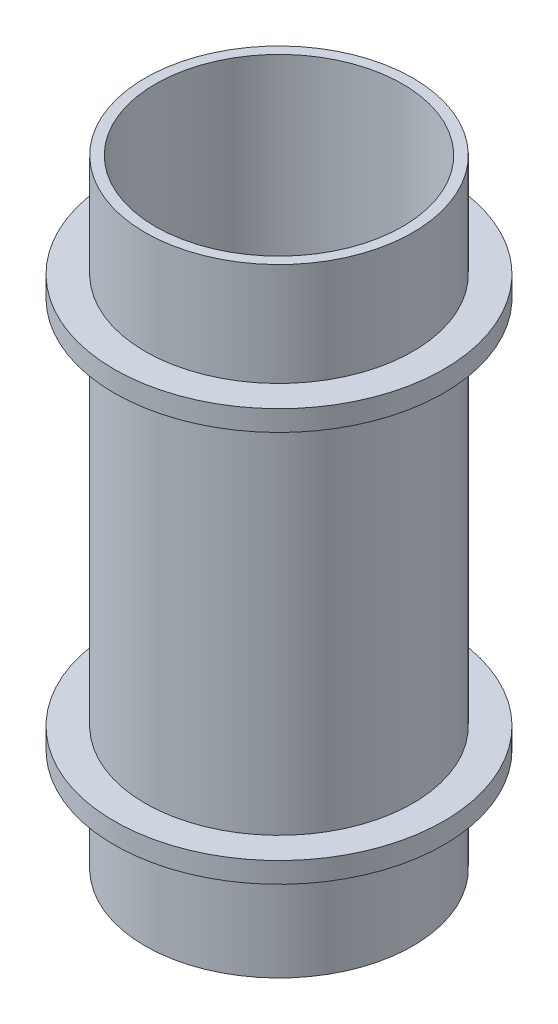
ISO-10303-21;
HEADER;
FILE_DESCRIPTION(('STEP AP214'),'2;1');
FILE_NAME('part.step','',(''),(''),'','','');
FILE_SCHEMA(('AUTOMOTIVE_DESIGN { 1 0 10303 214 1 1 1 1 }'));
ENDSEC;
DATA;
#1=APPLICATION_CONTEXT('core data for automotive mechanical design processes');
#2=APPLICATION_PROTOCOL_DEFINITION('international standard','automotive_design',2000,#1);
#3=PRODUCT_CONTEXT('',#1,'mechanical');
#4=PRODUCT('Part','Part','',(#3));
#5=PRODUCT_RELATED_PRODUCT_CATEGORY('part','',(#4));
#6=PRODUCT_DEFINITION_FORMATION('','',#4);
#7=PRODUCT_DEFINITION_CONTEXT('part definition',#1,'design');
#8=PRODUCT_DEFINITION('design','',#6,#7);
#9=PRODUCT_DEFINITION_SHAPE('','',#8);
#10=(LENGTH_UNIT() NAMED_UNIT(*) SI_UNIT(.MILLI.,.METRE.));
#11=(NAMED_UNIT(*) PLANE_ANGLE_UNIT() SI_UNIT($,.RADIAN.));
#12=(NAMED_UNIT(*) SI_UNIT($,.STERADIAN.) SOLID_ANGLE_UNIT());
#13=UNCERTAINTY_MEASURE_WITH_UNIT(LENGTH_MEASURE(1.E-05),#10,'distance_accuracy_value','');
#14=(GEOMETRIC_REPRESENTATION_CONTEXT(3) GLOBAL_UNCERTAINTY_ASSIGNED_CONTEXT((#13)) GLOBAL_UNIT_ASSIGNED_CONTEXT((#10,
#11,#12)) REPRESENTATION_CONTEXT('',''));
#15=CARTESIAN_POINT('',(0.,0.,0.));
#16=DIRECTION('',(0.,0.,1.));
#17=DIRECTION('',(1.,0.,0.));
#18=AXIS2_PLACEMENT_3D('',#15,#16,#17);
#19=CARTESIAN_POINT('',(0.,60.,0.));
#20=DIRECTION('',(0.,-1.,0.));
#21=DIRECTION('',(0.,0.,-1.));
#22=AXIS2_PLACEMENT_3D('',#19,#20,#21);
#23=CYLINDRICAL_SURFACE('',#22,13.);
#24=CARTESIAN_POINT('',(0.,48.,0.));
#25=DIRECTION('',(0.,1.,0.));
#26=DIRECTION('',(0.,0.,1.));
#27=AXIS2_PLACEMENT_3D('',#24,#25,#26);
#28=CIRCLE('',#27,13.);
#29=CARTESIAN_POINT('',(0.,48.,13.));
#30=VERTEX_POINT('',#29);
#31=EDGE_CURVE('E42',#30,#30,#28,.T.);
#32=ORIENTED_EDGE('',*,*,#31,.F.);
#33=EDGE_LOOP('',(#32));
#34=FACE_BOUND('',#33,.T.);
#35=CARTESIAN_POINT('',(0.,12.,0.));
#36=DIRECTION('',(0.,-1.,0.));
#37=DIRECTION('',(0.,0.,-1.));
#38=AXIS2_PLACEMENT_3D('',#35,#36,#37);
#39=CIRCLE('',#38,13.);
#40=CARTESIAN_POINT('',(0.,12.,-13.));
#41=VERTEX_POINT('',#40);
#42=EDGE_CURVE('E10',#41,#41,#39,.T.);
#43=ORIENTED_EDGE('',*,*,#42,.F.);
#44=EDGE_LOOP('',(#43));
#45=FACE_BOUND('',#44,.T.);
#46=ADVANCED_FACE('F34',(#34,#45),#23,.T.);
#47=CARTESIAN_POINT('',(0.,10.,0.));
#48=DIRECTION('',(0.,-1.,0.));
#49=DIRECTION('',(0.,0.,-1.));
#50=AXIS2_PLACEMENT_3D('',#47,#48,#49);
#51=CIRCLE('',#50,13.);
#52=CARTESIAN_POINT('',(0.,10.,-13.));
#53=VERTEX_POINT('',#52);
#54=EDGE_CURVE('E51',#53,#53,#51,.T.);
#55=ORIENTED_EDGE('',*,*,#54,.T.);
#56=EDGE_LOOP('',(#55));
#57=FACE_BOUND('',#56,.T.);
#58=CARTESIAN_POINT('',(0.,0.,0.));
#59=DIRECTION('',(0.,1.,0.));
#60=DIRECTION('',(0.,0.,1.));
#61=AXIS2_PLACEMENT_3D('',#58,#59,#60);
#62=CIRCLE('',#61,13.);
#63=CARTESIAN_POINT('',(0.,0.,13.));
#64=VERTEX_POINT('',#63);
#65=EDGE_CURVE('E38',#64,#64,#62,.T.);
#66=ORIENTED_EDGE('',*,*,#65,.T.);
#67=EDGE_LOOP('',(#66));
#68=FACE_BOUND('',#67,.T.);
#69=ADVANCED_FACE('F73',(#57,#68),#23,.T.);
#70=CARTESIAN_POINT('',(0.,60.,0.));
#71=DIRECTION('',(0.,1.,0.));
#72=DIRECTION('',(0.,0.,1.));
#73=AXIS2_PLACEMENT_3D('',#70,#71,#72);
#74=PLANE('',#73);
#75=CARTESIAN_POINT('',(0.,60.,0.));
#76=DIRECTION('',(0.,1.,0.));
#77=DIRECTION('',(0.,0.,1.));
#78=AXIS2_PLACEMENT_3D('',#75,#76,#77);
#79=CIRCLE('',#78,13.);
#80=CARTESIAN_POINT('',(0.,60.,13.));
#81=VERTEX_POINT('',#80);
#82=EDGE_CURVE('E47',#81,#81,#79,.T.);
#83=ORIENTED_EDGE('',*,*,#82,.T.);
#84=EDGE_LOOP('',(#83));
#85=FACE_BOUND('',#84,.T.);
#86=CARTESIAN_POINT('',(0.,60.,0.));
#87=DIRECTION('',(0.,1.,0.));
#88=DIRECTION('',(0.,0.,1.));
#89=AXIS2_PLACEMENT_3D('',#86,#87,#88);
#90=CIRCLE('',#89,12.);
#91=CARTESIAN_POINT('',(0.,60.,12.));
#92=VERTEX_POINT('',#91);
#93=EDGE_CURVE('E63',#92,#92,#90,.T.);
#94=ORIENTED_EDGE('',*,*,#93,.F.);
#95=EDGE_LOOP('',(#94));
#96=FACE_BOUND('',#95,.T.);
#97=ADVANCED_FACE('F78',(#85,#96),#74,.T.);
#98=CARTESIAN_POINT('',(0.,0.,0.));
#99=DIRECTION('',(0.,1.,0.));
#100=DIRECTION('',(0.,0.,1.));
#101=AXIS2_PLACEMENT_3D('',#98,#99,#100);
#102=PLANE('',#101);
#103=ORIENTED_EDGE('',*,*,#65,.F.);
#104=EDGE_LOOP('',(#103));
#105=FACE_BOUND('',#104,.T.);
#106=CARTESIAN_POINT('',(0.,0.,0.));
#107=DIRECTION('',(0.,1.,0.));
#108=DIRECTION('',(0.,0.,1.));
#109=AXIS2_PLACEMENT_3D('',#106,#107,#108);
#110=CIRCLE('',#109,12.);
#111=CARTESIAN_POINT('',(0.,0.,12.));
#112=VERTEX_POINT('',#111);
#113=EDGE_CURVE('E61',#112,#112,#110,.T.);
#114=ORIENTED_EDGE('',*,*,#113,.T.);
#115=EDGE_LOOP('',(#114));
#116=FACE_BOUND('',#115,.T.);
#117=ADVANCED_FACE('F75',(#105,#116),#102,.F.);
#118=CARTESIAN_POINT('',(0.,50.,0.));
#119=DIRECTION('',(0.,1.,0.));
#120=DIRECTION('',(0.,0.,1.));
#121=AXIS2_PLACEMENT_3D('',#118,#119,#120);
#122=CIRCLE('',#121,13.);
#123=CARTESIAN_POINT('',(0.,50.,13.));
#124=VERTEX_POINT('',#123);
#125=EDGE_CURVE('E56',#124,#124,#122,.T.);
#126=ORIENTED_EDGE('',*,*,#125,.T.);
#127=EDGE_LOOP('',(#126));
#128=FACE_BOUND('',#127,.T.);
#129=ORIENTED_EDGE('',*,*,#82,.F.);
#130=EDGE_LOOP('',(#129));
#131=FACE_BOUND('',#130,.T.);
#132=ADVANCED_FACE('F36',(#128,#131),#23,.T.);
#133=CARTESIAN_POINT('',(0.,60.,0.));
#134=DIRECTION('',(0.,-1.,0.));
#135=DIRECTION('',(0.,0.,-1.));
#136=AXIS2_PLACEMENT_3D('',#133,#134,#135);
#137=CYLINDRICAL_SURFACE('',#136,12.);
#138=ORIENTED_EDGE('',*,*,#113,.F.);
#139=EDGE_LOOP('',(#138));
#140=FACE_BOUND('',#139,.T.);
#141=ORIENTED_EDGE('',*,*,#93,.T.);
#142=EDGE_LOOP('',(#141));
#143=FACE_BOUND('',#142,.T.);
#144=ADVANCED_FACE('F81',(#140,#143),#137,.F.);
#145=CARTESIAN_POINT('',(0.,48.,0.));
#146=DIRECTION('',(0.,1.,0.));
#147=DIRECTION('',(0.,0.,1.));
#148=AXIS2_PLACEMENT_3D('',#145,#146,#147);
#149=PLANE('',#148);
#150=CARTESIAN_POINT('',(0.,48.,0.));
#151=DIRECTION('',(0.,1.,0.));
#152=DIRECTION('',(0.,0.,1.));
#153=AXIS2_PLACEMENT_3D('',#150,#151,#152);
#154=CIRCLE('',#153,16.);
#155=CARTESIAN_POINT('',(0.,48.,16.));
#156=VERTEX_POINT('',#155);
#157=EDGE_CURVE('E53',#156,#156,#154,.T.);
#158=ORIENTED_EDGE('',*,*,#157,.F.);
#159=EDGE_LOOP('',(#158));
#160=FACE_BOUND('',#159,.T.);
#161=ORIENTED_EDGE('',*,*,#31,.T.);
#162=EDGE_LOOP('',(#161));
#163=FACE_BOUND('',#162,.T.);
#164=ADVANCED_FACE('F84',(#160,#163),#149,.F.);
#165=CARTESIAN_POINT('',(0.,50.,0.));
#166=DIRECTION('',(0.,1.,0.));
#167=DIRECTION('',(0.,0.,1.));
#168=AXIS2_PLACEMENT_3D('',#165,#166,#167);
#169=PLANE('',#168);
#170=CARTESIAN_POINT('',(0.,50.,0.));
#171=DIRECTION('',(0.,1.,0.));
#172=DIRECTION('',(0.,0.,1.));
#173=AXIS2_PLACEMENT_3D('',#170,#171,#172);
#174=CIRCLE('',#173,16.);
#175=CARTESIAN_POINT('',(0.,50.,16.));
#176=VERTEX_POINT('',#175);
#177=EDGE_CURVE('E57',#176,#176,#174,.T.);
#178=ORIENTED_EDGE('',*,*,#177,.T.);
#179=EDGE_LOOP('',(#178));
#180=FACE_BOUND('',#179,.T.);
#181=ORIENTED_EDGE('',*,*,#125,.F.);
#182=EDGE_LOOP('',(#181));
#183=FACE_BOUND('',#182,.T.);
#184=ADVANCED_FACE('F107',(#180,#183),#169,.T.);
#185=CARTESIAN_POINT('',(0.,48.,0.));
#186=DIRECTION('',(0.,1.,0.));
#187=DIRECTION('',(0.,0.,1.));
#188=AXIS2_PLACEMENT_3D('',#185,#186,#187);
#189=CYLINDRICAL_SURFACE('',#188,16.);
#190=ORIENTED_EDGE('',*,*,#157,.T.);
#191=EDGE_LOOP('',(#190));
#192=FACE_BOUND('',#191,.T.);
#193=ORIENTED_EDGE('',*,*,#177,.F.);
#194=EDGE_LOOP('',(#193));
#195=FACE_BOUND('',#194,.T.);
#196=ADVANCED_FACE('F109',(#192,#195),#189,.T.);
#197=CARTESIAN_POINT('',(0.,12.,0.));
#198=DIRECTION('',(0.,-1.,0.));
#199=DIRECTION('',(0.,0.,-1.));
#200=AXIS2_PLACEMENT_3D('',#197,#198,#199);
#201=PLANE('',#200);
#202=CARTESIAN_POINT('',(0.,12.,0.));
#203=DIRECTION('',(0.,-1.,0.));
#204=DIRECTION('',(0.,0.,-1.));
#205=AXIS2_PLACEMENT_3D('',#202,#203,#204);
#206=CIRCLE('',#205,16.);
#207=CARTESIAN_POINT('',(0.,12.,-16.));
#208=VERTEX_POINT('',#207);
#209=EDGE_CURVE('E136',#208,#208,#206,.T.);
#210=ORIENTED_EDGE('',*,*,#209,.F.);
#211=EDGE_LOOP('',(#210));
#212=FACE_BOUND('',#211,.T.);
#213=ORIENTED_EDGE('',*,*,#42,.T.);
#214=EDGE_LOOP('',(#213));
#215=FACE_BOUND('',#214,.T.);
#216=ADVANCED_FACE('F116',(#212,#215),#201,.F.);
#217=CARTESIAN_POINT('',(0.,10.,0.));
#218=DIRECTION('',(0.,-1.,0.));
#219=DIRECTION('',(0.,0.,-1.));
#220=AXIS2_PLACEMENT_3D('',#217,#218,#219);
#221=PLANE('',#220);
#222=CARTESIAN_POINT('',(0.,10.,0.));
#223=DIRECTION('',(0.,-1.,0.));
#224=DIRECTION('',(0.,0.,-1.));
#225=AXIS2_PLACEMENT_3D('',#222,#223,#224);
#226=CIRCLE('',#225,16.);
#227=CARTESIAN_POINT('',(0.,10.,-16.));
#228=VERTEX_POINT('',#227);
#229=EDGE_CURVE('E137',#228,#228,#226,.T.);
#230=ORIENTED_EDGE('',*,*,#229,.T.);
#231=EDGE_LOOP('',(#230));
#232=FACE_BOUND('',#231,.T.);
#233=ORIENTED_EDGE('',*,*,#54,.F.);
#234=EDGE_LOOP('',(#233));
#235=FACE_BOUND('',#234,.T.);
#236=ADVANCED_FACE('F125',(#232,#235),#221,.T.);
#237=CARTESIAN_POINT('',(0.,12.,0.));
#238=DIRECTION('',(0.,-1.,0.));
#239=DIRECTION('',(0.,0.,-1.));
#240=AXIS2_PLACEMENT_3D('',#237,#238,#239);
#241=CYLINDRICAL_SURFACE('',#240,16.);
#242=ORIENTED_EDGE('',*,*,#209,.T.);
#243=EDGE_LOOP('',(#242));
#244=FACE_BOUND('',#243,.T.);
#245=ORIENTED_EDGE('',*,*,#229,.F.);
#246=EDGE_LOOP('',(#245));
#247=FACE_BOUND('',#246,.T.);
#248=ADVANCED_FACE('F122',(#244,#247),#241,.T.);
#249=CLOSED_SHELL('',(#46,#69,#97,#117,#132,#144,#164,#184,#196,#216,#236,#248));
#250=MANIFOLD_SOLID_BREP('B2',#249);
#251=ADVANCED_BREP_SHAPE_REPRESENTATION('',(#18,#250),#14);
#252=SHAPE_DEFINITION_REPRESENTATION(#9,#251);
ENDSEC;
END-ISO-10303-21;
